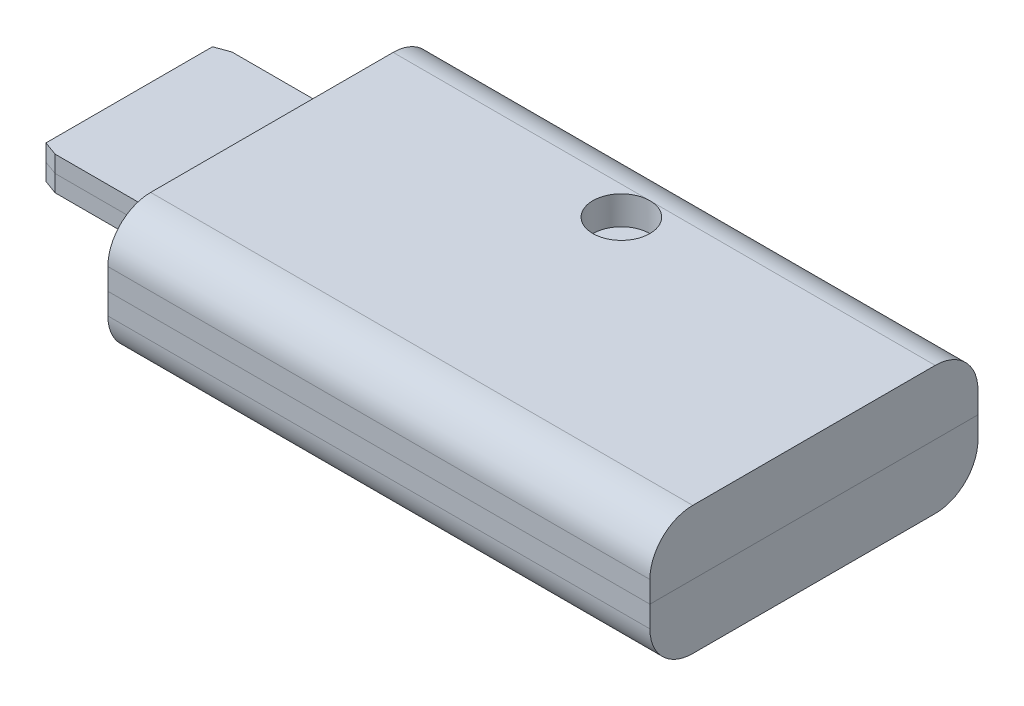
ISO-10303-21;
HEADER;
FILE_DESCRIPTION(('STEP AP214'),'2;1');
FILE_NAME('part.step','',(''),(''),'','','');
FILE_SCHEMA(('AUTOMOTIVE_DESIGN { 1 0 10303 214 1 1 1 1 }'));
ENDSEC;
DATA;
#1=APPLICATION_CONTEXT('core data for automotive mechanical design processes');
#2=APPLICATION_PROTOCOL_DEFINITION('international standard','automotive_design',2000,#1);
#3=PRODUCT_CONTEXT('',#1,'mechanical');
#4=PRODUCT('Part','Part','',(#3));
#5=PRODUCT_RELATED_PRODUCT_CATEGORY('part','',(#4));
#6=PRODUCT_DEFINITION_FORMATION('','',#4);
#7=PRODUCT_DEFINITION_CONTEXT('part definition',#1,'design');
#8=PRODUCT_DEFINITION('design','',#6,#7);
#9=PRODUCT_DEFINITION_SHAPE('','',#8);
#10=(LENGTH_UNIT() NAMED_UNIT(*) SI_UNIT(.MILLI.,.METRE.));
#11=(NAMED_UNIT(*) PLANE_ANGLE_UNIT() SI_UNIT($,.RADIAN.));
#12=(NAMED_UNIT(*) SI_UNIT($,.STERADIAN.) SOLID_ANGLE_UNIT());
#13=UNCERTAINTY_MEASURE_WITH_UNIT(LENGTH_MEASURE(1.E-05),#10,'distance_accuracy_value','');
#14=(GEOMETRIC_REPRESENTATION_CONTEXT(3) GLOBAL_UNCERTAINTY_ASSIGNED_CONTEXT((#13)) GLOBAL_UNIT_ASSIGNED_CONTEXT((#10,
#11,#12)) REPRESENTATION_CONTEXT('',''));
#15=CARTESIAN_POINT('',(0.,0.,0.));
#16=DIRECTION('',(0.,0.,1.));
#17=DIRECTION('',(1.,0.,0.));
#18=AXIS2_PLACEMENT_3D('',#15,#16,#17);
#19=CARTESIAN_POINT('',(19.,9.,-11.5000000000001));
#20=DIRECTION('',(-1.,0.,0.));
#21=DIRECTION('',(0.,0.,1.));
#22=AXIS2_PLACEMENT_3D('',#19,#20,#21);
#23=PLANE('',#22);
#24=DIRECTION('',(0.,-1.,0.));
#25=VECTOR('',#24,1.);
#26=CARTESIAN_POINT('',(19.,9.,11.4999999999999));
#27=LINE('',#26,#25);
#28=CARTESIAN_POINT('',(19.,6.,11.4999999999999));
#29=VERTEX_POINT('',#28);
#30=CARTESIAN_POINT('',(19.,4.5,11.4999999999999));
#31=VERTEX_POINT('',#30);
#32=EDGE_CURVE('E229',#29,#31,#27,.T.);
#33=ORIENTED_EDGE('',*,*,#32,.T.);
#34=DIRECTION('',(0.,0.,-1.));
#35=VECTOR('',#34,1.);
#36=CARTESIAN_POINT('',(19.,4.5,-11.5000000000001));
#37=LINE('',#36,#35);
#38=CARTESIAN_POINT('',(19.,4.5,-11.5000000000001));
#39=VERTEX_POINT('',#38);
#40=EDGE_CURVE('E11',#31,#39,#37,.T.);
#41=ORIENTED_EDGE('',*,*,#40,.T.);
#42=DIRECTION('',(0.,-1.,0.));
#43=VECTOR('',#42,1.);
#44=CARTESIAN_POINT('',(19.,9.,-11.5000000000001));
#45=LINE('',#44,#43);
#46=CARTESIAN_POINT('',(19.,6.,-11.5000000000001));
#47=VERTEX_POINT('',#46);
#48=EDGE_CURVE('E226',#47,#39,#45,.T.);
#49=ORIENTED_EDGE('',*,*,#48,.F.);
#50=CARTESIAN_POINT('',(19.,6.,-8.50000000000007));
#51=DIRECTION('',(-1.,0.,0.));
#52=DIRECTION('',(0.,0.,1.));
#53=AXIS2_PLACEMENT_3D('',#50,#51,#52);
#54=CIRCLE('',#53,3.);
#55=CARTESIAN_POINT('',(19.,9.,-8.50000000000007));
#56=VERTEX_POINT('',#55);
#57=EDGE_CURVE('E264',#47,#56,#54,.F.);
#58=ORIENTED_EDGE('',*,*,#57,.T.);
#59=DIRECTION('',(0.,0.,-1.));
#60=VECTOR('',#59,1.);
#61=CARTESIAN_POINT('',(19.,9.,-11.5000000000001));
#62=LINE('',#61,#60);
#63=CARTESIAN_POINT('',(19.,9.,8.49999999999993));
#64=VERTEX_POINT('',#63);
#65=EDGE_CURVE('E215',#64,#56,#62,.T.);
#66=ORIENTED_EDGE('',*,*,#65,.F.);
#67=CARTESIAN_POINT('',(19.,6.,8.49999999999993));
#68=DIRECTION('',(-1.,0.,0.));
#69=DIRECTION('',(0.,0.,1.));
#70=AXIS2_PLACEMENT_3D('',#67,#68,#69);
#71=CIRCLE('',#70,3.);
#72=EDGE_CURVE('E270',#64,#29,#71,.F.);
#73=ORIENTED_EDGE('',*,*,#72,.T.);
#74=EDGE_LOOP('',(#33,#41,#49,#58,#66,#73));
#75=FACE_BOUND('',#74,.T.);
#76=ADVANCED_FACE('F34',(#75),#23,.F.);
#77=CARTESIAN_POINT('',(-19.,9.,-11.4999999999999));
#78=DIRECTION('',(0.,0.,1.));
#79=DIRECTION('',(1.,0.,0.));
#80=AXIS2_PLACEMENT_3D('',#77,#78,#79);
#81=PLANE('',#80);
#82=ORIENTED_EDGE('',*,*,#48,.T.);
#83=DIRECTION('',(-1.,0.,0.));
#84=VECTOR('',#83,1.);
#85=CARTESIAN_POINT('',(-19.,4.5,-11.4999999999999));
#86=LINE('',#85,#84);
#87=CARTESIAN_POINT('',(-19.,4.5,-11.4999999999999));
#88=VERTEX_POINT('',#87);
#89=EDGE_CURVE('E43',#39,#88,#86,.T.);
#90=ORIENTED_EDGE('',*,*,#89,.T.);
#91=DIRECTION('',(0.,-1.,0.));
#92=VECTOR('',#91,1.);
#93=CARTESIAN_POINT('',(-19.,9.,-11.4999999999999));
#94=LINE('',#93,#92);
#95=CARTESIAN_POINT('',(-19.,6.,-11.4999999999999));
#96=VERTEX_POINT('',#95);
#97=EDGE_CURVE('E222',#96,#88,#94,.T.);
#98=ORIENTED_EDGE('',*,*,#97,.F.);
#99=DIRECTION('',(-1.,0.,0.));
#100=VECTOR('',#99,1.);
#101=CARTESIAN_POINT('',(19.,6.,-11.5000000000001));
#102=LINE('',#101,#100);
#103=EDGE_CURVE('E262',#96,#47,#102,.F.);
#104=ORIENTED_EDGE('',*,*,#103,.T.);
#105=EDGE_LOOP('',(#82,#90,#98,#104));
#106=FACE_BOUND('',#105,.T.);
#107=ADVANCED_FACE('F338',(#106),#81,.F.);
#108=CARTESIAN_POINT('',(-19.,9.,-11.4999999999999));
#109=DIRECTION('',(1.,0.,0.));
#110=DIRECTION('',(0.,0.,-1.));
#111=AXIS2_PLACEMENT_3D('',#108,#109,#110);
#112=PLANE('',#111);
#113=DIRECTION('',(0.,1.,0.));
#114=VECTOR('',#113,1.);
#115=CARTESIAN_POINT('',(-19.,3.325,6.20000000000001));
#116=LINE('',#115,#114);
#117=CARTESIAN_POINT('',(-19.,4.5,6.20000000000001));
#118=VERTEX_POINT('',#117);
#119=CARTESIAN_POINT('',(-19.,5.675,6.20000000000002));
#120=VERTEX_POINT('',#119);
#121=EDGE_CURVE('E189',#118,#120,#116,.T.);
#122=ORIENTED_EDGE('',*,*,#121,.F.);
#123=DIRECTION('',(0.,0.,1.));
#124=VECTOR('',#123,1.);
#125=CARTESIAN_POINT('',(-19.,4.5,-11.4999999999999));
#126=LINE('',#125,#124);
#127=CARTESIAN_POINT('',(-19.,4.5,11.5000000000001));
#128=VERTEX_POINT('',#127);
#129=EDGE_CURVE('E186',#118,#128,#126,.T.);
#130=ORIENTED_EDGE('',*,*,#129,.T.);
#131=DIRECTION('',(0.,-1.,0.));
#132=VECTOR('',#131,1.);
#133=CARTESIAN_POINT('',(-19.,9.,11.5000000000001));
#134=LINE('',#133,#132);
#135=CARTESIAN_POINT('',(-19.,6.,11.5000000000001));
#136=VERTEX_POINT('',#135);
#137=EDGE_CURVE('E232',#136,#128,#134,.T.);
#138=ORIENTED_EDGE('',*,*,#137,.F.);
#139=CARTESIAN_POINT('',(-19.,6.,8.50000000000007));
#140=DIRECTION('',(1.,0.,0.));
#141=DIRECTION('',(0.,0.,-1.));
#142=AXIS2_PLACEMENT_3D('',#139,#140,#141);
#143=CIRCLE('',#142,3.);
#144=CARTESIAN_POINT('',(-19.,9.,8.50000000000007));
#145=VERTEX_POINT('',#144);
#146=EDGE_CURVE('E274',#136,#145,#143,.F.);
#147=ORIENTED_EDGE('',*,*,#146,.T.);
#148=DIRECTION('',(0.,0.,1.));
#149=VECTOR('',#148,1.);
#150=CARTESIAN_POINT('',(-19.,9.,-11.4999999999999));
#151=LINE('',#150,#149);
#152=CARTESIAN_POINT('',(-19.,9.,-8.49999999999992));
#153=VERTEX_POINT('',#152);
#154=EDGE_CURVE('E212',#153,#145,#151,.T.);
#155=ORIENTED_EDGE('',*,*,#154,.F.);
#156=CARTESIAN_POINT('',(-19.,6.,-8.49999999999992));
#157=DIRECTION('',(1.,0.,0.));
#158=DIRECTION('',(0.,0.,-1.));
#159=AXIS2_PLACEMENT_3D('',#156,#157,#158);
#160=CIRCLE('',#159,3.);
#161=EDGE_CURVE('E260',#153,#96,#160,.F.);
#162=ORIENTED_EDGE('',*,*,#161,.T.);
#163=ORIENTED_EDGE('',*,*,#97,.T.);
#164=DIRECTION('',(0.,0.,1.));
#165=VECTOR('',#164,1.);
#166=CARTESIAN_POINT('',(-19.,4.5,-11.4999999999999));
#167=LINE('',#166,#165);
#168=CARTESIAN_POINT('',(-19.,4.5,-6.19999999999999));
#169=VERTEX_POINT('',#168);
#170=EDGE_CURVE('E321',#88,#169,#167,.T.);
#171=ORIENTED_EDGE('',*,*,#170,.T.);
#172=DIRECTION('',(0.,-1.,0.));
#173=VECTOR('',#172,1.);
#174=CARTESIAN_POINT('',(-19.,3.325,-6.19999999999999));
#175=LINE('',#174,#173);
#176=CARTESIAN_POINT('',(-19.,5.675,-6.19999999999999));
#177=VERTEX_POINT('',#176);
#178=EDGE_CURVE('E196',#177,#169,#175,.T.);
#179=ORIENTED_EDGE('',*,*,#178,.F.);
#180=DIRECTION('',(0.,0.,-1.));
#181=VECTOR('',#180,1.);
#182=CARTESIAN_POINT('',(-19.,5.675,6.20000000000001));
#183=LINE('',#182,#181);
#184=EDGE_CURVE('E188',#120,#177,#183,.T.);
#185=ORIENTED_EDGE('',*,*,#184,.F.);
#186=EDGE_LOOP('',(#122,#130,#138,#147,#155,#162,#163,#171,#179,#185));
#187=FACE_BOUND('',#186,.T.);
#188=ADVANCED_FACE('F370',(#187),#112,.F.);
#189=CARTESIAN_POINT('',(-29.,3.325,-6.19999999999998));
#190=DIRECTION('',(0.,0.,1.));
#191=DIRECTION('',(1.,0.,0.));
#192=AXIS2_PLACEMENT_3D('',#189,#190,#191);
#193=PLANE('',#192);
#194=ORIENTED_EDGE('',*,*,#178,.T.);
#195=DIRECTION('',(-1.,0.,0.));
#196=VECTOR('',#195,1.);
#197=CARTESIAN_POINT('',(-29.,4.5,-6.19999999999998));
#198=LINE('',#197,#196);
#199=CARTESIAN_POINT('',(-28.,4.5,-6.19999999999998));
#200=VERTEX_POINT('',#199);
#201=EDGE_CURVE('E318',#169,#200,#198,.T.);
#202=ORIENTED_EDGE('',*,*,#201,.T.);
#203=DIRECTION('',(0.,1.,0.));
#204=VECTOR('',#203,1.);
#205=CARTESIAN_POINT('',(-28.,5.675,-6.19999999999998));
#206=LINE('',#205,#204);
#207=CARTESIAN_POINT('',(-28.,5.675,-6.19999999999998));
#208=VERTEX_POINT('',#207);
#209=EDGE_CURVE('E288',#200,#208,#206,.T.);
#210=ORIENTED_EDGE('',*,*,#209,.T.);
#211=DIRECTION('',(1.,0.,0.));
#212=VECTOR('',#211,1.);
#213=CARTESIAN_POINT('',(-29.,5.675,-6.19999999999998));
#214=LINE('',#213,#212);
#215=EDGE_CURVE('E206',#208,#177,#214,.T.);
#216=ORIENTED_EDGE('',*,*,#215,.T.);
#217=EDGE_LOOP('',(#194,#202,#210,#216));
#218=FACE_BOUND('',#217,.T.);
#219=ADVANCED_FACE('F479',(#218),#193,.F.);
#220=CARTESIAN_POINT('',(-29.,0.,-5.83602976573377));
#221=DIRECTION('',(-0.34202014332567,0.,-0.939692620785908));
#222=DIRECTION('',(0.,1.,0.));
#223=AXIS2_PLACEMENT_3D('',#220,#221,#222);
#224=PLANE('',#223);
#225=DIRECTION('',(0.,-1.,0.));
#226=VECTOR('',#225,1.);
#227=CARTESIAN_POINT('',(-29.,3.325,-5.83602976573377));
#228=LINE('',#227,#226);
#229=CARTESIAN_POINT('',(-29.,4.5,-5.83602976573377));
#230=VERTEX_POINT('',#229);
#231=CARTESIAN_POINT('',(-29.,3.325,-5.83602976573377));
#232=VERTEX_POINT('',#231);
#233=EDGE_CURVE('E280',#230,#232,#228,.T.);
#234=ORIENTED_EDGE('',*,*,#233,.F.);
#235=DIRECTION('',(0.939692620785908,0.,-0.34202014332567));
#236=VECTOR('',#235,1.);
#237=CARTESIAN_POINT('',(-29.,4.5,-5.83602976573377));
#238=LINE('',#237,#236);
#239=EDGE_CURVE('E314',#230,#200,#238,.T.);
#240=ORIENTED_EDGE('',*,*,#239,.T.);
#241=CARTESIAN_POINT('',(-28.,3.325,-6.19999999999998));
#242=VERTEX_POINT('',#241);
#243=EDGE_CURVE('E289',#242,#200,#206,.T.);
#244=ORIENTED_EDGE('',*,*,#243,.F.);
#245=DIRECTION('',(0.939692620785908,0.,-0.34202014332567));
#246=VECTOR('',#245,1.);
#247=CARTESIAN_POINT('',(-29.,3.325,-5.83602976573377));
#248=LINE('',#247,#246);
#249=EDGE_CURVE('E286',#232,#242,#248,.T.);
#250=ORIENTED_EDGE('',*,*,#249,.F.);
#251=EDGE_LOOP('',(#234,#240,#244,#250));
#252=FACE_BOUND('',#251,.T.);
#253=ADVANCED_FACE('F457',(#252),#224,.T.);
#254=CARTESIAN_POINT('',(-29.,0.,0.));
#255=DIRECTION('',(-1.,0.,0.));
#256=DIRECTION('',(0.,0.,1.));
#257=AXIS2_PLACEMENT_3D('',#254,#255,#256);
#258=PLANE('',#257);
#259=DIRECTION('',(0.,1.,0.));
#260=VECTOR('',#259,1.);
#261=CARTESIAN_POINT('',(-29.,5.675,5.83602976573382));
#262=LINE('',#261,#260);
#263=CARTESIAN_POINT('',(-29.,3.325,5.83602976573382));
#264=VERTEX_POINT('',#263);
#265=CARTESIAN_POINT('',(-29.,4.5,5.83602976573382));
#266=VERTEX_POINT('',#265);
#267=EDGE_CURVE('E277',#264,#266,#262,.T.);
#268=ORIENTED_EDGE('',*,*,#267,.T.);
#269=DIRECTION('',(0.,0.,-1.));
#270=VECTOR('',#269,1.);
#271=CARTESIAN_POINT('',(-29.,4.5,0.));
#272=LINE('',#271,#270);
#273=EDGE_CURVE('E310',#266,#230,#272,.T.);
#274=ORIENTED_EDGE('',*,*,#273,.T.);
#275=ORIENTED_EDGE('',*,*,#233,.T.);
#276=DIRECTION('',(0.,0.,1.));
#277=VECTOR('',#276,1.);
#278=CARTESIAN_POINT('',(-29.,3.325,6.20000000000002));
#279=LINE('',#278,#277);
#280=EDGE_CURVE('E178',#232,#264,#279,.T.);
#281=ORIENTED_EDGE('',*,*,#280,.T.);
#282=EDGE_LOOP('',(#268,#274,#275,#281));
#283=FACE_BOUND('',#282,.T.);
#284=ADVANCED_FACE('F478',(#283),#258,.T.);
#285=CARTESIAN_POINT('',(-29.,3.325,6.20000000000002));
#286=DIRECTION('',(0.,0.,-1.));
#287=DIRECTION('',(-1.,0.,0.));
#288=AXIS2_PLACEMENT_3D('',#285,#286,#287);
#289=PLANE('',#288);
#290=DIRECTION('',(0.,-1.,0.));
#291=VECTOR('',#290,1.);
#292=CARTESIAN_POINT('',(-28.,3.325,6.20000000000002));
#293=LINE('',#292,#291);
#294=CARTESIAN_POINT('',(-28.,5.675,6.20000000000002));
#295=VERTEX_POINT('',#294);
#296=CARTESIAN_POINT('',(-28.,4.5,6.20000000000002));
#297=VERTEX_POINT('',#296);
#298=EDGE_CURVE('E296',#295,#297,#293,.T.);
#299=ORIENTED_EDGE('',*,*,#298,.T.);
#300=DIRECTION('',(1.,0.,0.));
#301=VECTOR('',#300,1.);
#302=CARTESIAN_POINT('',(-29.,4.5,6.20000000000002));
#303=LINE('',#302,#301);
#304=EDGE_CURVE('E307',#297,#118,#303,.T.);
#305=ORIENTED_EDGE('',*,*,#304,.T.);
#306=ORIENTED_EDGE('',*,*,#121,.T.);
#307=DIRECTION('',(1.,0.,0.));
#308=VECTOR('',#307,1.);
#309=CARTESIAN_POINT('',(-29.,5.675,6.20000000000002));
#310=LINE('',#309,#308);
#311=EDGE_CURVE('E208',#295,#120,#310,.T.);
#312=ORIENTED_EDGE('',*,*,#311,.F.);
#313=EDGE_LOOP('',(#299,#305,#306,#312));
#314=FACE_BOUND('',#313,.T.);
#315=ADVANCED_FACE('F490',(#314),#289,.F.);
#316=CARTESIAN_POINT('',(-29.,0.,5.83602976573382));
#317=DIRECTION('',(-0.342020143325666,0.,0.939692620785909));
#318=DIRECTION('',(0.,-1.,0.));
#319=AXIS2_PLACEMENT_3D('',#316,#317,#318);
#320=PLANE('',#319);
#321=CARTESIAN_POINT('',(-28.,3.325,6.20000000000002));
#322=VERTEX_POINT('',#321);
#323=EDGE_CURVE('E173',#297,#322,#293,.T.);
#324=ORIENTED_EDGE('',*,*,#323,.F.);
#325=DIRECTION('',(-0.939692620785909,0.,-0.342020143325666));
#326=VECTOR('',#325,1.);
#327=CARTESIAN_POINT('',(-29.,4.5,5.83602976573382));
#328=LINE('',#327,#326);
#329=EDGE_CURVE('E303',#297,#266,#328,.T.);
#330=ORIENTED_EDGE('',*,*,#329,.T.);
#331=ORIENTED_EDGE('',*,*,#267,.F.);
#332=DIRECTION('',(-0.939692620785909,0.,-0.342020143325666));
#333=VECTOR('',#332,1.);
#334=CARTESIAN_POINT('',(-29.,3.325,5.83602976573382));
#335=LINE('',#334,#333);
#336=EDGE_CURVE('E284',#322,#264,#335,.T.);
#337=ORIENTED_EDGE('',*,*,#336,.F.);
#338=EDGE_LOOP('',(#324,#330,#331,#337));
#339=FACE_BOUND('',#338,.T.);
#340=ADVANCED_FACE('F468',(#339),#320,.T.);
#341=CARTESIAN_POINT('',(-19.,9.,11.5000000000001));
#342=DIRECTION('',(0.,0.,-1.));
#343=DIRECTION('',(-1.,0.,0.));
#344=AXIS2_PLACEMENT_3D('',#341,#342,#343);
#345=PLANE('',#344);
#346=ORIENTED_EDGE('',*,*,#137,.T.);
#347=DIRECTION('',(1.,0.,0.));
#348=VECTOR('',#347,1.);
#349=CARTESIAN_POINT('',(-19.,4.5,11.5000000000001));
#350=LINE('',#349,#348);
#351=EDGE_CURVE('E299',#128,#31,#350,.T.);
#352=ORIENTED_EDGE('',*,*,#351,.T.);
#353=ORIENTED_EDGE('',*,*,#32,.F.);
#354=DIRECTION('',(1.,0.,0.));
#355=VECTOR('',#354,1.);
#356=CARTESIAN_POINT('',(-19.,6.,11.5000000000001));
#357=LINE('',#356,#355);
#358=EDGE_CURVE('E272',#29,#136,#357,.F.);
#359=ORIENTED_EDGE('',*,*,#358,.T.);
#360=EDGE_LOOP('',(#346,#352,#353,#359));
#361=FACE_BOUND('',#360,.T.);
#362=ADVANCED_FACE('F389',(#361),#345,.F.);
#363=CARTESIAN_POINT('',(0.,0.,0.));
#364=DIRECTION('',(0.,1.,0.));
#365=DIRECTION('',(0.,0.,1.));
#366=AXIS2_PLACEMENT_3D('',#363,#364,#365);
#367=PLANE('',#366);
#368=DIRECTION('',(0.,0.,-1.));
#369=VECTOR('',#368,1.);
#370=CARTESIAN_POINT('',(19.,0.,-11.5000000000001));
#371=LINE('',#370,#369);
#372=CARTESIAN_POINT('',(19.,0.,8.49999999999993));
#373=VERTEX_POINT('',#372);
#374=CARTESIAN_POINT('',(19.,0.,-8.50000000000007));
#375=VERTEX_POINT('',#374);
#376=EDGE_CURVE('E216',#373,#375,#371,.T.);
#377=ORIENTED_EDGE('',*,*,#376,.F.);
#378=DIRECTION('',(1.,0.,0.));
#379=VECTOR('',#378,1.);
#380=CARTESIAN_POINT('',(0.,0.,8.5));
#381=LINE('',#380,#379);
#382=CARTESIAN_POINT('',(-19.,0.,8.50000000000007));
#383=VERTEX_POINT('',#382);
#384=EDGE_CURVE('E251',#373,#383,#381,.F.);
#385=ORIENTED_EDGE('',*,*,#384,.T.);
#386=DIRECTION('',(0.,0.,1.));
#387=VECTOR('',#386,1.);
#388=CARTESIAN_POINT('',(-19.,0.,-11.4999999999999));
#389=LINE('',#388,#387);
#390=CARTESIAN_POINT('',(-19.,0.,-8.49999999999992));
#391=VERTEX_POINT('',#390);
#392=EDGE_CURVE('E211',#391,#383,#389,.T.);
#393=ORIENTED_EDGE('',*,*,#392,.F.);
#394=DIRECTION('',(-1.,0.,0.));
#395=VECTOR('',#394,1.);
#396=CARTESIAN_POINT('',(0.,0.,-8.5));
#397=LINE('',#396,#395);
#398=EDGE_CURVE('E240',#391,#375,#397,.F.);
#399=ORIENTED_EDGE('',*,*,#398,.T.);
#400=EDGE_LOOP('',(#377,#385,#393,#399));
#401=FACE_BOUND('',#400,.T.);
#402=CARTESIAN_POINT('',(-13.,0.,0.));
#403=DIRECTION('',(0.,-1.,0.));
#404=DIRECTION('',(0.,0.,-1.));
#405=AXIS2_PLACEMENT_3D('',#402,#403,#404);
#406=CIRCLE('',#405,1.5);
#407=CARTESIAN_POINT('',(-13.,0.,-1.5));
#408=VERTEX_POINT('',#407);
#409=EDGE_CURVE('E759',#408,#408,#406,.T.);
#410=ORIENTED_EDGE('',*,*,#409,.F.);
#411=EDGE_LOOP('',(#410));
#412=FACE_BOUND('',#411,.T.);
#413=CARTESIAN_POINT('',(14.,0.,6.50000000000007));
#414=DIRECTION('',(0.,-1.,0.));
#415=DIRECTION('',(0.,0.,-1.));
#416=AXIS2_PLACEMENT_3D('',#413,#414,#415);
#417=CIRCLE('',#416,1.5);
#418=CARTESIAN_POINT('',(14.,0.,5.00000000000007));
#419=VERTEX_POINT('',#418);
#420=EDGE_CURVE('E763',#419,#419,#417,.T.);
#421=ORIENTED_EDGE('',*,*,#420,.F.);
#422=EDGE_LOOP('',(#421));
#423=FACE_BOUND('',#422,.T.);
#424=CARTESIAN_POINT('',(14.,0.,-6.50000000000007));
#425=DIRECTION('',(0.,1.,0.));
#426=DIRECTION('',(0.,0.,1.));
#427=AXIS2_PLACEMENT_3D('',#424,#425,#426);
#428=CIRCLE('',#427,1.5);
#429=CARTESIAN_POINT('',(14.,0.,-5.00000000000007));
#430=VERTEX_POINT('',#429);
#431=EDGE_CURVE('E766',#430,#430,#428,.T.);
#432=ORIENTED_EDGE('',*,*,#431,.T.);
#433=EDGE_LOOP('',(#432));
#434=FACE_BOUND('',#433,.T.);
#435=ADVANCED_FACE('F398',(#401,#412,#423,#434),#367,.F.);
#436=ORIENTED_EDGE('',*,*,#129,.F.);
#437=CARTESIAN_POINT('',(-19.,3.325,6.20000000000001));
#438=VERTEX_POINT('',#437);
#439=EDGE_CURVE('E171',#438,#118,#116,.T.);
#440=ORIENTED_EDGE('',*,*,#439,.F.);
#441=DIRECTION('',(0.,0.,1.));
#442=VECTOR('',#441,1.);
#443=CARTESIAN_POINT('',(-19.,3.325,6.20000000000001));
#444=LINE('',#443,#442);
#445=CARTESIAN_POINT('',(-19.,3.325,-6.19999999999999));
#446=VERTEX_POINT('',#445);
#447=EDGE_CURVE('E184',#446,#438,#444,.T.);
#448=ORIENTED_EDGE('',*,*,#447,.F.);
#449=EDGE_CURVE('E201',#169,#446,#175,.T.);
#450=ORIENTED_EDGE('',*,*,#449,.F.);
#451=ORIENTED_EDGE('',*,*,#170,.F.);
#452=CARTESIAN_POINT('',(-19.,3.,-11.4999999999999));
#453=VERTEX_POINT('',#452);
#454=EDGE_CURVE('E218',#88,#453,#94,.T.);
#455=ORIENTED_EDGE('',*,*,#454,.T.);
#456=CARTESIAN_POINT('',(-19.,3.,-8.49999999999992));
#457=DIRECTION('',(1.,0.,0.));
#458=DIRECTION('',(0.,0.,-1.));
#459=AXIS2_PLACEMENT_3D('',#456,#457,#458);
#460=CIRCLE('',#459,3.);
#461=EDGE_CURVE('E238',#453,#391,#460,.F.);
#462=ORIENTED_EDGE('',*,*,#461,.T.);
#463=ORIENTED_EDGE('',*,*,#392,.T.);
#464=CARTESIAN_POINT('',(-19.,3.,8.50000000000007));
#465=DIRECTION('',(1.,0.,0.));
#466=DIRECTION('',(0.,0.,-1.));
#467=AXIS2_PLACEMENT_3D('',#464,#465,#466);
#468=CIRCLE('',#467,3.);
#469=CARTESIAN_POINT('',(-19.,3.,11.5000000000001));
#470=VERTEX_POINT('',#469);
#471=EDGE_CURVE('E253',#383,#470,#468,.F.);
#472=ORIENTED_EDGE('',*,*,#471,.T.);
#473=EDGE_CURVE('E231',#128,#470,#134,.T.);
#474=ORIENTED_EDGE('',*,*,#473,.F.);
#475=EDGE_LOOP('',(#436,#440,#448,#450,#451,#455,#462,#463,#472,#474));
#476=FACE_BOUND('',#475,.T.);
#477=ADVANCED_FACE('F182',(#476),#112,.F.);
#478=ORIENTED_EDGE('',*,*,#351,.F.);
#479=ORIENTED_EDGE('',*,*,#473,.T.);
#480=DIRECTION('',(1.,0.,0.));
#481=VECTOR('',#480,1.);
#482=CARTESIAN_POINT('',(-19.,3.,11.5000000000001));
#483=LINE('',#482,#481);
#484=CARTESIAN_POINT('',(19.,3.,11.4999999999999));
#485=VERTEX_POINT('',#484);
#486=EDGE_CURVE('E246',#470,#485,#483,.T.);
#487=ORIENTED_EDGE('',*,*,#486,.T.);
#488=EDGE_CURVE('E228',#31,#485,#27,.T.);
#489=ORIENTED_EDGE('',*,*,#488,.F.);
#490=EDGE_LOOP('',(#478,#479,#487,#489));
#491=FACE_BOUND('',#490,.T.);
#492=ADVANCED_FACE('F358',(#491),#345,.F.);
#493=ORIENTED_EDGE('',*,*,#40,.F.);
#494=ORIENTED_EDGE('',*,*,#488,.T.);
#495=CARTESIAN_POINT('',(19.,3.,8.49999999999993));
#496=DIRECTION('',(-1.,0.,0.));
#497=DIRECTION('',(0.,0.,1.));
#498=AXIS2_PLACEMENT_3D('',#495,#496,#497);
#499=CIRCLE('',#498,3.);
#500=EDGE_CURVE('E249',#485,#373,#499,.F.);
#501=ORIENTED_EDGE('',*,*,#500,.T.);
#502=ORIENTED_EDGE('',*,*,#376,.T.);
#503=CARTESIAN_POINT('',(19.,3.,-8.50000000000007));
#504=DIRECTION('',(-1.,0.,0.));
#505=DIRECTION('',(0.,0.,1.));
#506=AXIS2_PLACEMENT_3D('',#503,#504,#505);
#507=CIRCLE('',#506,3.);
#508=CARTESIAN_POINT('',(19.,3.,-11.5000000000001));
#509=VERTEX_POINT('',#508);
#510=EDGE_CURVE('E243',#375,#509,#507,.F.);
#511=ORIENTED_EDGE('',*,*,#510,.T.);
#512=EDGE_CURVE('E225',#39,#509,#45,.T.);
#513=ORIENTED_EDGE('',*,*,#512,.F.);
#514=EDGE_LOOP('',(#493,#494,#501,#502,#511,#513));
#515=FACE_BOUND('',#514,.T.);
#516=ADVANCED_FACE('F335',(#515),#23,.F.);
#517=ORIENTED_EDGE('',*,*,#89,.F.);
#518=ORIENTED_EDGE('',*,*,#512,.T.);
#519=DIRECTION('',(-1.,0.,0.));
#520=VECTOR('',#519,1.);
#521=CARTESIAN_POINT('',(-19.,3.,-11.4999999999999));
#522=LINE('',#521,#520);
#523=EDGE_CURVE('E235',#509,#453,#522,.T.);
#524=ORIENTED_EDGE('',*,*,#523,.T.);
#525=ORIENTED_EDGE('',*,*,#454,.F.);
#526=EDGE_LOOP('',(#517,#518,#524,#525));
#527=FACE_BOUND('',#526,.T.);
#528=ADVANCED_FACE('F329',(#527),#81,.F.);
#529=CARTESIAN_POINT('',(0.,9.,0.));
#530=DIRECTION('',(0.,1.,0.));
#531=DIRECTION('',(0.,0.,1.));
#532=AXIS2_PLACEMENT_3D('',#529,#530,#531);
#533=PLANE('',#532);
#534=DIRECTION('',(-1.,0.,0.));
#535=VECTOR('',#534,1.);
#536=CARTESIAN_POINT('',(-19.,9.,-8.49999999999992));
#537=LINE('',#536,#535);
#538=CARTESIAN_POINT('',(-1.00000000000001,9.,-8.49999999999999));
#539=VERTEX_POINT('',#538);
#540=EDGE_CURVE('E257',#56,#539,#537,.T.);
#541=ORIENTED_EDGE('',*,*,#540,.T.);
#542=CARTESIAN_POINT('',(-1.00000000000001,9.,-6.49999999999992));
#543=DIRECTION('',(0.,1.,0.));
#544=DIRECTION('',(0.,0.,1.));
#545=AXIS2_PLACEMENT_3D('',#542,#543,#544);
#546=CIRCLE('',#545,2.);
#547=EDGE_CURVE('E724',#539,#539,#546,.T.);
#548=ORIENTED_EDGE('',*,*,#547,.F.);
#549=EDGE_CURVE('E256',#539,#153,#537,.T.);
#550=ORIENTED_EDGE('',*,*,#549,.T.);
#551=ORIENTED_EDGE('',*,*,#154,.T.);
#552=DIRECTION('',(1.,0.,0.));
#553=VECTOR('',#552,1.);
#554=CARTESIAN_POINT('',(19.,9.,8.49999999999993));
#555=LINE('',#554,#553);
#556=EDGE_CURVE('E267',#145,#64,#555,.T.);
#557=ORIENTED_EDGE('',*,*,#556,.T.);
#558=ORIENTED_EDGE('',*,*,#65,.T.);
#559=EDGE_LOOP('',(#541,#548,#550,#551,#557,#558));
#560=FACE_BOUND('',#559,.T.);
#561=ADVANCED_FACE('F334',(#560),#533,.T.);
#562=ORIENTED_EDGE('',*,*,#304,.F.);
#563=ORIENTED_EDGE('',*,*,#323,.T.);
#564=DIRECTION('',(1.,0.,0.));
#565=VECTOR('',#564,1.);
#566=CARTESIAN_POINT('',(-29.,3.325,6.20000000000002));
#567=LINE('',#566,#565);
#568=EDGE_CURVE('E168',#322,#438,#567,.T.);
#569=ORIENTED_EDGE('',*,*,#568,.T.);
#570=ORIENTED_EDGE('',*,*,#439,.T.);
#571=EDGE_LOOP('',(#562,#563,#569,#570));
#572=FACE_BOUND('',#571,.T.);
#573=ADVANCED_FACE('F170',(#572),#289,.F.);
#574=CARTESIAN_POINT('',(-29.,5.675,6.20000000000002));
#575=DIRECTION('',(0.,-1.,0.));
#576=DIRECTION('',(0.,0.,-1.));
#577=AXIS2_PLACEMENT_3D('',#574,#575,#576);
#578=PLANE('',#577);
#579=ORIENTED_EDGE('',*,*,#215,.F.);
#580=DIRECTION('',(-0.939692620785908,0.,0.34202014332567));
#581=VECTOR('',#580,1.);
#582=CARTESIAN_POINT('',(-29.,5.675,-5.83602976573377));
#583=LINE('',#582,#581);
#584=CARTESIAN_POINT('',(-29.,5.675,-5.83602976573377));
#585=VERTEX_POINT('',#584);
#586=EDGE_CURVE('E294',#208,#585,#583,.T.);
#587=ORIENTED_EDGE('',*,*,#586,.T.);
#588=DIRECTION('',(0.,0.,-1.));
#589=VECTOR('',#588,1.);
#590=CARTESIAN_POINT('',(-29.,5.675,6.20000000000002));
#591=LINE('',#590,#589);
#592=CARTESIAN_POINT('',(-29.,5.675,5.83602976573382));
#593=VERTEX_POINT('',#592);
#594=EDGE_CURVE('E195',#593,#585,#591,.T.);
#595=ORIENTED_EDGE('',*,*,#594,.F.);
#596=DIRECTION('',(0.939692620785909,0.,0.342020143325666));
#597=VECTOR('',#596,1.);
#598=CARTESIAN_POINT('',(-29.,5.675,5.83602976573382));
#599=LINE('',#598,#597);
#600=EDGE_CURVE('E292',#593,#295,#599,.T.);
#601=ORIENTED_EDGE('',*,*,#600,.T.);
#602=ORIENTED_EDGE('',*,*,#311,.T.);
#603=ORIENTED_EDGE('',*,*,#184,.T.);
#604=EDGE_LOOP('',(#579,#587,#595,#601,#602,#603));
#605=FACE_BOUND('',#604,.T.);
#606=ADVANCED_FACE('F509',(#605),#578,.F.);
#607=ORIENTED_EDGE('',*,*,#201,.F.);
#608=ORIENTED_EDGE('',*,*,#449,.T.);
#609=DIRECTION('',(1.,0.,0.));
#610=VECTOR('',#609,1.);
#611=CARTESIAN_POINT('',(-29.,3.325,-6.19999999999998));
#612=LINE('',#611,#610);
#613=EDGE_CURVE('E177',#242,#446,#612,.T.);
#614=ORIENTED_EDGE('',*,*,#613,.F.);
#615=ORIENTED_EDGE('',*,*,#243,.T.);
#616=EDGE_LOOP('',(#607,#608,#614,#615));
#617=FACE_BOUND('',#616,.T.);
#618=ADVANCED_FACE('F503',(#617),#193,.F.);
#619=CARTESIAN_POINT('',(-29.,3.325,6.20000000000002));
#620=DIRECTION('',(0.,1.,0.));
#621=DIRECTION('',(0.,0.,1.));
#622=AXIS2_PLACEMENT_3D('',#619,#620,#621);
#623=PLANE('',#622);
#624=ORIENTED_EDGE('',*,*,#280,.F.);
#625=ORIENTED_EDGE('',*,*,#249,.T.);
#626=ORIENTED_EDGE('',*,*,#613,.T.);
#627=ORIENTED_EDGE('',*,*,#447,.T.);
#628=ORIENTED_EDGE('',*,*,#568,.F.);
#629=ORIENTED_EDGE('',*,*,#336,.T.);
#630=EDGE_LOOP('',(#624,#625,#626,#627,#628,#629));
#631=FACE_BOUND('',#630,.T.);
#632=ADVANCED_FACE('F193',(#631),#623,.F.);
#633=ORIENTED_EDGE('',*,*,#273,.F.);
#634=EDGE_CURVE('E276',#266,#593,#262,.T.);
#635=ORIENTED_EDGE('',*,*,#634,.T.);
#636=ORIENTED_EDGE('',*,*,#594,.T.);
#637=EDGE_CURVE('E281',#585,#230,#228,.T.);
#638=ORIENTED_EDGE('',*,*,#637,.T.);
#639=EDGE_LOOP('',(#633,#635,#636,#638));
#640=FACE_BOUND('',#639,.T.);
#641=ADVANCED_FACE('F411',(#640),#258,.T.);
#642=CARTESIAN_POINT('',(-19.,3.,-8.49999999999992));
#643=DIRECTION('',(-1.,0.,0.));
#644=DIRECTION('',(0.,0.,1.));
#645=AXIS2_PLACEMENT_3D('',#642,#643,#644);
#646=CYLINDRICAL_SURFACE('',#645,3.);
#647=ORIENTED_EDGE('',*,*,#510,.F.);
#648=ORIENTED_EDGE('',*,*,#398,.F.);
#649=ORIENTED_EDGE('',*,*,#461,.F.);
#650=ORIENTED_EDGE('',*,*,#523,.F.);
#651=EDGE_LOOP('',(#647,#648,#649,#650));
#652=FACE_BOUND('',#651,.T.);
#653=ADVANCED_FACE('F406',(#652),#646,.T.);
#654=CARTESIAN_POINT('',(-19.,3.,8.50000000000007));
#655=DIRECTION('',(1.,0.,0.));
#656=DIRECTION('',(0.,0.,-1.));
#657=AXIS2_PLACEMENT_3D('',#654,#655,#656);
#658=CYLINDRICAL_SURFACE('',#657,3.);
#659=ORIENTED_EDGE('',*,*,#471,.F.);
#660=ORIENTED_EDGE('',*,*,#384,.F.);
#661=ORIENTED_EDGE('',*,*,#500,.F.);
#662=ORIENTED_EDGE('',*,*,#486,.F.);
#663=EDGE_LOOP('',(#659,#660,#661,#662));
#664=FACE_BOUND('',#663,.T.);
#665=ADVANCED_FACE('F410',(#664),#658,.T.);
#666=CARTESIAN_POINT('',(0.,6.,-8.5));
#667=DIRECTION('',(1.,0.,0.));
#668=DIRECTION('',(0.,0.,-1.));
#669=AXIS2_PLACEMENT_3D('',#666,#667,#668);
#670=CYLINDRICAL_SURFACE('',#669,3.);
#671=ORIENTED_EDGE('',*,*,#57,.F.);
#672=ORIENTED_EDGE('',*,*,#103,.F.);
#673=ORIENTED_EDGE('',*,*,#161,.F.);
#674=ORIENTED_EDGE('',*,*,#549,.F.);
#675=ORIENTED_EDGE('',*,*,#540,.F.);
#676=EDGE_LOOP('',(#671,#672,#673,#674,#675));
#677=FACE_BOUND('',#676,.T.);
#678=ADVANCED_FACE('F423',(#677),#670,.T.);
#679=CARTESIAN_POINT('',(0.,6.,8.5));
#680=DIRECTION('',(-1.,0.,0.));
#681=DIRECTION('',(0.,0.,1.));
#682=AXIS2_PLACEMENT_3D('',#679,#680,#681);
#683=CYLINDRICAL_SURFACE('',#682,3.);
#684=ORIENTED_EDGE('',*,*,#146,.F.);
#685=ORIENTED_EDGE('',*,*,#358,.F.);
#686=ORIENTED_EDGE('',*,*,#72,.F.);
#687=ORIENTED_EDGE('',*,*,#556,.F.);
#688=EDGE_LOOP('',(#684,#685,#686,#687));
#689=FACE_BOUND('',#688,.T.);
#690=ADVANCED_FACE('F434',(#689),#683,.T.);
#691=ORIENTED_EDGE('',*,*,#239,.F.);
#692=ORIENTED_EDGE('',*,*,#637,.F.);
#693=ORIENTED_EDGE('',*,*,#586,.F.);
#694=ORIENTED_EDGE('',*,*,#209,.F.);
#695=EDGE_LOOP('',(#691,#692,#693,#694));
#696=FACE_BOUND('',#695,.T.);
#697=ADVANCED_FACE('F445',(#696),#224,.T.);
#698=ORIENTED_EDGE('',*,*,#329,.F.);
#699=ORIENTED_EDGE('',*,*,#298,.F.);
#700=ORIENTED_EDGE('',*,*,#600,.F.);
#701=ORIENTED_EDGE('',*,*,#634,.F.);
#702=EDGE_LOOP('',(#698,#699,#700,#701));
#703=FACE_BOUND('',#702,.T.);
#704=ADVANCED_FACE('F36',(#703),#320,.T.);
#705=CARTESIAN_POINT('',(-1.00000000000001,7.,-6.49999999999992));
#706=DIRECTION('',(0.,1.,0.));
#707=DIRECTION('',(0.,0.,1.));
#708=AXIS2_PLACEMENT_3D('',#705,#706,#707);
#709=CYLINDRICAL_SURFACE('',#708,2.);
#710=CARTESIAN_POINT('',(-1.00000000000001,7.,-6.49999999999992));
#711=DIRECTION('',(0.,1.,0.));
#712=DIRECTION('',(0.,0.,1.));
#713=AXIS2_PLACEMENT_3D('',#710,#711,#712);
#714=CIRCLE('',#713,2.);
#715=CARTESIAN_POINT('',(-1.00000000000001,7.,-4.49999999999992));
#716=VERTEX_POINT('',#715);
#717=EDGE_CURVE('E722',#716,#716,#714,.T.);
#718=ORIENTED_EDGE('',*,*,#717,.F.);
#719=EDGE_LOOP('',(#718));
#720=FACE_BOUND('',#719,.T.);
#721=ORIENTED_EDGE('',*,*,#547,.T.);
#722=EDGE_LOOP('',(#721));
#723=FACE_BOUND('',#722,.T.);
#724=ADVANCED_FACE('F466',(#720,#723),#709,.F.);
#725=CARTESIAN_POINT('',(-1.00000000000001,7.,-6.49999999999992));
#726=DIRECTION('',(0.,1.,0.));
#727=DIRECTION('',(0.,0.,1.));
#728=AXIS2_PLACEMENT_3D('',#725,#726,#727);
#729=PLANE('',#728);
#730=ORIENTED_EDGE('',*,*,#717,.T.);
#731=EDGE_LOOP('',(#730));
#732=FACE_BOUND('',#731,.T.);
#733=ADVANCED_FACE('F632',(#732),#729,.T.);
#734=CARTESIAN_POINT('',(-13.,2.,0.));
#735=DIRECTION('',(0.,-1.,0.));
#736=DIRECTION('',(0.,0.,-1.));
#737=AXIS2_PLACEMENT_3D('',#734,#735,#736);
#738=CYLINDRICAL_SURFACE('',#737,1.5);
#739=CARTESIAN_POINT('',(-13.,2.,0.));
#740=DIRECTION('',(0.,-1.,0.));
#741=DIRECTION('',(0.,0.,-1.));
#742=AXIS2_PLACEMENT_3D('',#739,#740,#741);
#743=CIRCLE('',#742,1.5);
#744=CARTESIAN_POINT('',(-13.,2.,-1.5));
#745=VERTEX_POINT('',#744);
#746=EDGE_CURVE('E777',#745,#745,#743,.T.);
#747=ORIENTED_EDGE('',*,*,#746,.F.);
#748=EDGE_LOOP('',(#747));
#749=FACE_BOUND('',#748,.T.);
#750=ORIENTED_EDGE('',*,*,#409,.T.);
#751=EDGE_LOOP('',(#750));
#752=FACE_BOUND('',#751,.T.);
#753=ADVANCED_FACE('F621',(#749,#752),#738,.F.);
#754=CARTESIAN_POINT('',(-13.,2.,0.));
#755=DIRECTION('',(0.,-1.,0.));
#756=DIRECTION('',(0.,0.,-1.));
#757=AXIS2_PLACEMENT_3D('',#754,#755,#756);
#758=PLANE('',#757);
#759=ORIENTED_EDGE('',*,*,#746,.T.);
#760=EDGE_LOOP('',(#759));
#761=FACE_BOUND('',#760,.T.);
#762=ADVANCED_FACE('F610',(#761),#758,.T.);
#763=CARTESIAN_POINT('',(14.,2.,6.50000000000007));
#764=DIRECTION('',(0.,-1.,0.));
#765=DIRECTION('',(0.,0.,-1.));
#766=AXIS2_PLACEMENT_3D('',#763,#764,#765);
#767=CYLINDRICAL_SURFACE('',#766,1.5);
#768=CARTESIAN_POINT('',(14.,2.,6.50000000000007));
#769=DIRECTION('',(0.,-1.,0.));
#770=DIRECTION('',(0.,0.,-1.));
#771=AXIS2_PLACEMENT_3D('',#768,#769,#770);
#772=CIRCLE('',#771,1.5);
#773=CARTESIAN_POINT('',(14.,2.,5.00000000000007));
#774=VERTEX_POINT('',#773);
#775=EDGE_CURVE('E773',#774,#774,#772,.T.);
#776=ORIENTED_EDGE('',*,*,#775,.F.);
#777=EDGE_LOOP('',(#776));
#778=FACE_BOUND('',#777,.T.);
#779=ORIENTED_EDGE('',*,*,#420,.T.);
#780=EDGE_LOOP('',(#779));
#781=FACE_BOUND('',#780,.T.);
#782=ADVANCED_FACE('F599',(#778,#781),#767,.F.);
#783=CARTESIAN_POINT('',(14.,2.,6.50000000000007));
#784=DIRECTION('',(0.,-1.,0.));
#785=DIRECTION('',(0.,0.,-1.));
#786=AXIS2_PLACEMENT_3D('',#783,#784,#785);
#787=PLANE('',#786);
#788=ORIENTED_EDGE('',*,*,#775,.T.);
#789=EDGE_LOOP('',(#788));
#790=FACE_BOUND('',#789,.T.);
#791=ADVANCED_FACE('F588',(#790),#787,.T.);
#792=CARTESIAN_POINT('',(14.,2.,-6.50000000000007));
#793=DIRECTION('',(0.,-1.,0.));
#794=DIRECTION('',(0.,0.,-1.));
#795=AXIS2_PLACEMENT_3D('',#792,#793,#794);
#796=CYLINDRICAL_SURFACE('',#795,1.5);
#797=CARTESIAN_POINT('',(14.,2.,-6.50000000000007));
#798=DIRECTION('',(0.,1.,0.));
#799=DIRECTION('',(0.,0.,1.));
#800=AXIS2_PLACEMENT_3D('',#797,#798,#799);
#801=CIRCLE('',#800,1.5);
#802=CARTESIAN_POINT('',(14.,2.,-5.00000000000007));
#803=VERTEX_POINT('',#802);
#804=EDGE_CURVE('E768',#803,#803,#801,.T.);
#805=ORIENTED_EDGE('',*,*,#804,.T.);
#806=EDGE_LOOP('',(#805));
#807=FACE_BOUND('',#806,.T.);
#808=ORIENTED_EDGE('',*,*,#431,.F.);
#809=EDGE_LOOP('',(#808));
#810=FACE_BOUND('',#809,.T.);
#811=ADVANCED_FACE('F577',(#807,#810),#796,.F.);
#812=CARTESIAN_POINT('',(14.,2.,-6.50000000000007));
#813=DIRECTION('',(0.,-1.,0.));
#814=DIRECTION('',(0.,0.,1.));
#815=AXIS2_PLACEMENT_3D('',#812,#813,#814);
#816=PLANE('',#815);
#817=ORIENTED_EDGE('',*,*,#804,.F.);
#818=EDGE_LOOP('',(#817));
#819=FACE_BOUND('',#818,.T.);
#820=ADVANCED_FACE('F573',(#819),#816,.T.);
#821=CLOSED_SHELL('',(#76,#107,#188,#219,#253,#284,#315,#340,#362,#435,#477,#492,#516,#528,#561,
#573,#606,#618,#632,#641,#653,#665,#678,#690,#697,#704,#724,#733,#753,#762,#782,#791,#811,#820));
#822=MANIFOLD_SOLID_BREP('B2',#821);
#823=ADVANCED_BREP_SHAPE_REPRESENTATION('',(#18,#822),#14);
#824=SHAPE_DEFINITION_REPRESENTATION(#9,#823);
ENDSEC;
END-ISO-10303-21;
